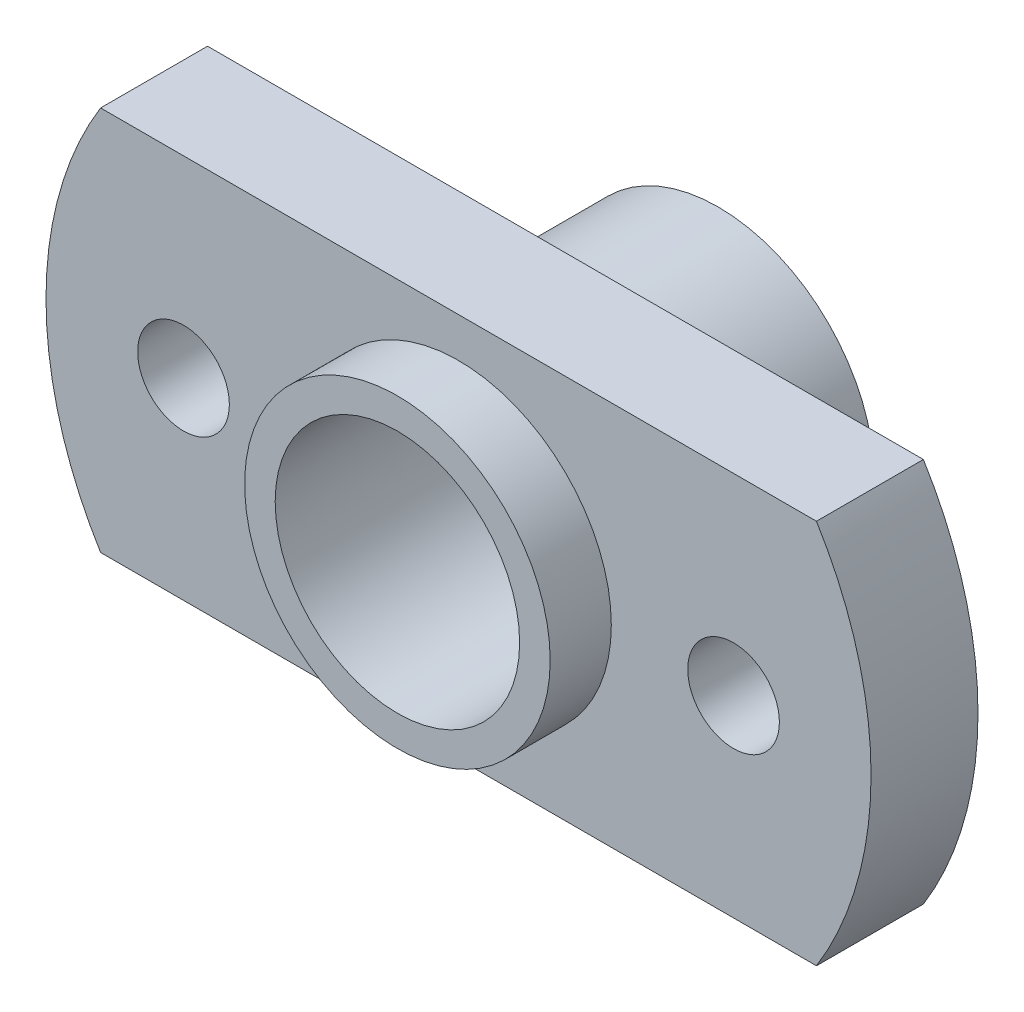
ISO-10303-21;
HEADER;
FILE_DESCRIPTION(('STEP AP214'),'2;1');
FILE_NAME('part.step','',(''),(''),'','','');
FILE_SCHEMA(('AUTOMOTIVE_DESIGN { 1 0 10303 214 1 1 1 1 }'));
ENDSEC;
DATA;
#1=APPLICATION_CONTEXT('core data for automotive mechanical design processes');
#2=APPLICATION_PROTOCOL_DEFINITION('international standard','automotive_design',2000,#1);
#3=PRODUCT_CONTEXT('',#1,'mechanical');
#4=PRODUCT('Part','Part','',(#3));
#5=PRODUCT_RELATED_PRODUCT_CATEGORY('part','',(#4));
#6=PRODUCT_DEFINITION_FORMATION('','',#4);
#7=PRODUCT_DEFINITION_CONTEXT('part definition',#1,'design');
#8=PRODUCT_DEFINITION('design','',#6,#7);
#9=PRODUCT_DEFINITION_SHAPE('','',#8);
#10=(LENGTH_UNIT() NAMED_UNIT(*) SI_UNIT(.MILLI.,.METRE.));
#11=(NAMED_UNIT(*) PLANE_ANGLE_UNIT() SI_UNIT($,.RADIAN.));
#12=(NAMED_UNIT(*) SI_UNIT($,.STERADIAN.) SOLID_ANGLE_UNIT());
#13=UNCERTAINTY_MEASURE_WITH_UNIT(LENGTH_MEASURE(1.E-05),#10,'distance_accuracy_value','');
#14=(GEOMETRIC_REPRESENTATION_CONTEXT(3) GLOBAL_UNCERTAINTY_ASSIGNED_CONTEXT((#13)) GLOBAL_UNIT_ASSIGNED_CONTEXT((#10,
#11,#12)) REPRESENTATION_CONTEXT('',''));
#15=CARTESIAN_POINT('',(0.,0.,0.));
#16=DIRECTION('',(0.,0.,1.));
#17=DIRECTION('',(1.,0.,0.));
#18=AXIS2_PLACEMENT_3D('',#15,#16,#17);
#19=CARTESIAN_POINT('',(-167.599999999995,-80.5000578860021,180.5264319846));
#20=DIRECTION('',(0.,0.,-1.));
#21=DIRECTION('',(-1.,0.,0.));
#22=AXIS2_PLACEMENT_3D('',#19,#20,#21);
#23=CYLINDRICAL_SURFACE('',#22,11.9999999999984);
#24=CARTESIAN_POINT('',(-167.599999999995,-80.5000578860021,177.0264319846));
#25=DIRECTION('',(0.,0.,-1.));
#26=DIRECTION('',(-1.,0.,0.));
#27=AXIS2_PLACEMENT_3D('',#24,#25,#26);
#28=CIRCLE('',#27,11.9999999999984);
#29=CARTESIAN_POINT('',(-177.813226718329,-86.8000578859906,177.0264319846));
#30=VERTEX_POINT('',#29);
#31=CARTESIAN_POINT('',(-177.813226718328,-74.2000578860111,177.0264319846));
#32=VERTEX_POINT('',#31);
#33=EDGE_CURVE('E105',#30,#32,#28,.T.);
#34=ORIENTED_EDGE('',*,*,#33,.F.);
#35=DIRECTION('',(0.,0.,-1.));
#36=VECTOR('',#35,1.);
#37=CARTESIAN_POINT('',(-177.813226718329,-86.8000578859906,180.5264319846));
#38=LINE('',#37,#36);
#39=CARTESIAN_POINT('',(-177.813226718329,-86.8000578859906,180.5264319846));
#40=VERTEX_POINT('',#39);
#41=EDGE_CURVE('E55',#40,#30,#38,.T.);
#42=ORIENTED_EDGE('',*,*,#41,.F.);
#43=CARTESIAN_POINT('',(-167.599999999995,-80.5000578860021,180.5264319846));
#44=DIRECTION('',(0.,0.,-1.));
#45=DIRECTION('',(-1.,0.,0.));
#46=AXIS2_PLACEMENT_3D('',#43,#44,#45);
#47=CIRCLE('',#46,11.9999999999984);
#48=CARTESIAN_POINT('',(-177.813226718328,-74.2000578860111,180.5264319846));
#49=VERTEX_POINT('',#48);
#50=EDGE_CURVE('E98',#40,#49,#47,.T.);
#51=ORIENTED_EDGE('',*,*,#50,.T.);
#52=DIRECTION('',(0.,0.,-1.));
#53=VECTOR('',#52,1.);
#54=CARTESIAN_POINT('',(-177.813226718328,-74.2000578860111,180.5264319846));
#55=LINE('',#54,#53);
#56=EDGE_CURVE('E40',#49,#32,#55,.T.);
#57=ORIENTED_EDGE('',*,*,#56,.T.);
#58=EDGE_LOOP('',(#34,#42,#51,#57));
#59=FACE_BOUND('',#58,.T.);
#60=ADVANCED_FACE('F37',(#59),#23,.T.);
#61=CARTESIAN_POINT('',(-154.386773281659,-86.8000578859906,180.5264319846));
#62=DIRECTION('',(0.,-1.,0.));
#63=DIRECTION('',(0.,0.,-1.));
#64=AXIS2_PLACEMENT_3D('',#61,#62,#63);
#65=PLANE('',#64);
#66=DIRECTION('',(-1.,0.,0.));
#67=VECTOR('',#66,1.);
#68=CARTESIAN_POINT('',(-154.386773281659,-86.8000578859906,177.0264319846));
#69=LINE('',#68,#67);
#70=CARTESIAN_POINT('',(-154.386773281658,-86.8000578859908,177.0264319846));
#71=VERTEX_POINT('',#70);
#72=EDGE_CURVE('E100',#71,#30,#69,.T.);
#73=ORIENTED_EDGE('',*,*,#72,.F.);
#74=DIRECTION('',(0.,0.,-1.));
#75=VECTOR('',#74,1.);
#76=CARTESIAN_POINT('',(-154.386773281658,-86.8000578859908,180.5264319846));
#77=LINE('',#76,#75);
#78=CARTESIAN_POINT('',(-154.386773281658,-86.8000578859908,180.5264319846));
#79=VERTEX_POINT('',#78);
#80=EDGE_CURVE('E72',#79,#71,#77,.T.);
#81=ORIENTED_EDGE('',*,*,#80,.F.);
#82=DIRECTION('',(-1.,0.,0.));
#83=VECTOR('',#82,1.);
#84=CARTESIAN_POINT('',(-154.386773281659,-86.8000578859906,180.5264319846));
#85=LINE('',#84,#83);
#86=EDGE_CURVE('E95',#79,#40,#85,.T.);
#87=ORIENTED_EDGE('',*,*,#86,.T.);
#88=ORIENTED_EDGE('',*,*,#41,.T.);
#89=EDGE_LOOP('',(#73,#81,#87,#88));
#90=FACE_BOUND('',#89,.T.);
#91=ADVANCED_FACE('F164',(#90),#65,.T.);
#92=CARTESIAN_POINT('',(-164.6,-80.50005788601,180.5264319846));
#93=DIRECTION('',(0.,0.,-1.));
#94=DIRECTION('',(-1.,0.,0.));
#95=AXIS2_PLACEMENT_3D('',#92,#93,#94);
#96=CYLINDRICAL_SURFACE('',#95,12.0000000000004);
#97=CARTESIAN_POINT('',(-164.6,-80.50005788601,177.0264319846));
#98=DIRECTION('',(0.,0.,-1.));
#99=DIRECTION('',(-1.,0.,0.));
#100=AXIS2_PLACEMENT_3D('',#97,#98,#99);
#101=CIRCLE('',#100,12.0000000000004);
#102=CARTESIAN_POINT('',(-154.386773281669,-74.2000578860111,177.0264319846));
#103=VERTEX_POINT('',#102);
#104=EDGE_CURVE('E90',#103,#71,#101,.T.);
#105=ORIENTED_EDGE('',*,*,#104,.F.);
#106=DIRECTION('',(0.,0.,-1.));
#107=VECTOR('',#106,1.);
#108=CARTESIAN_POINT('',(-154.386773281669,-74.2000578860111,180.5264319846));
#109=LINE('',#108,#107);
#110=CARTESIAN_POINT('',(-154.386773281669,-74.2000578860111,180.5264319846));
#111=VERTEX_POINT('',#110);
#112=EDGE_CURVE('E85',#111,#103,#109,.T.);
#113=ORIENTED_EDGE('',*,*,#112,.F.);
#114=CARTESIAN_POINT('',(-164.6,-80.50005788601,180.5264319846));
#115=DIRECTION('',(0.,0.,-1.));
#116=DIRECTION('',(-1.,0.,0.));
#117=AXIS2_PLACEMENT_3D('',#114,#115,#116);
#118=CIRCLE('',#117,12.0000000000004);
#119=EDGE_CURVE('E88',#111,#79,#118,.T.);
#120=ORIENTED_EDGE('',*,*,#119,.T.);
#121=ORIENTED_EDGE('',*,*,#80,.T.);
#122=EDGE_LOOP('',(#105,#113,#120,#121));
#123=FACE_BOUND('',#122,.T.);
#124=ADVANCED_FACE('F87',(#123),#96,.T.);
#125=CARTESIAN_POINT('',(-177.813226718328,-74.2000578860111,180.5264319846));
#126=DIRECTION('',(0.,1.,0.));
#127=DIRECTION('',(-1.,0.,0.));
#128=AXIS2_PLACEMENT_3D('',#125,#126,#127);
#129=PLANE('',#128);
#130=DIRECTION('',(1.,0.,0.));
#131=VECTOR('',#130,1.);
#132=CARTESIAN_POINT('',(-177.813226718328,-74.2000578860111,177.0264319846));
#133=LINE('',#132,#131);
#134=EDGE_CURVE('E108',#32,#103,#133,.T.);
#135=ORIENTED_EDGE('',*,*,#134,.F.);
#136=ORIENTED_EDGE('',*,*,#56,.F.);
#137=DIRECTION('',(1.,0.,0.));
#138=VECTOR('',#137,1.);
#139=CARTESIAN_POINT('',(-177.813226718328,-74.2000578860111,180.5264319846));
#140=LINE('',#139,#138);
#141=EDGE_CURVE('E94',#49,#111,#140,.T.);
#142=ORIENTED_EDGE('',*,*,#141,.T.);
#143=ORIENTED_EDGE('',*,*,#112,.T.);
#144=EDGE_LOOP('',(#135,#136,#142,#143));
#145=FACE_BOUND('',#144,.T.);
#146=ADVANCED_FACE('F97',(#145),#129,.T.);
#147=CARTESIAN_POINT('',(-167.599999999995,-80.5000578860021,180.5264319846));
#148=DIRECTION('',(0.,0.,-1.));
#149=DIRECTION('',(-1.,0.,0.));
#150=AXIS2_PLACEMENT_3D('',#147,#148,#149);
#151=PLANE('',#150);
#152=CARTESIAN_POINT('',(-157.1,-80.50005788601,180.5264319846));
#153=DIRECTION('',(0.,0.,1.));
#154=DIRECTION('',(1.,0.,0.));
#155=AXIS2_PLACEMENT_3D('',#152,#153,#154);
#156=CIRCLE('',#155,1.5);
#157=CARTESIAN_POINT('',(-155.6,-80.50005788601,180.5264319846));
#158=VERTEX_POINT('',#157);
#159=EDGE_CURVE('E133',#158,#158,#156,.T.);
#160=ORIENTED_EDGE('',*,*,#159,.F.);
#161=EDGE_LOOP('',(#160));
#162=FACE_BOUND('',#161,.T.);
#163=CARTESIAN_POINT('',(-175.1,-80.50005788601,180.5264319846));
#164=DIRECTION('',(0.,0.,1.));
#165=DIRECTION('',(1.,0.,0.));
#166=AXIS2_PLACEMENT_3D('',#163,#164,#165);
#167=CIRCLE('',#166,1.5);
#168=CARTESIAN_POINT('',(-173.6,-80.50005788601,180.5264319846));
#169=VERTEX_POINT('',#168);
#170=EDGE_CURVE('E127',#169,#169,#167,.T.);
#171=ORIENTED_EDGE('',*,*,#170,.F.);
#172=EDGE_LOOP('',(#171));
#173=FACE_BOUND('',#172,.T.);
#174=CARTESIAN_POINT('',(-166.1,-80.50005788601,180.5264319846));
#175=DIRECTION('',(0.,0.,1.));
#176=DIRECTION('',(1.,0.,0.));
#177=AXIS2_PLACEMENT_3D('',#174,#175,#176);
#178=CIRCLE('',#177,5.);
#179=CARTESIAN_POINT('',(-161.1,-80.50005788601,180.5264319846));
#180=VERTEX_POINT('',#179);
#181=EDGE_CURVE('E46',#180,#180,#178,.T.);
#182=ORIENTED_EDGE('',*,*,#181,.F.);
#183=EDGE_LOOP('',(#182));
#184=FACE_BOUND('',#183,.T.);
#185=ORIENTED_EDGE('',*,*,#50,.F.);
#186=ORIENTED_EDGE('',*,*,#86,.F.);
#187=ORIENTED_EDGE('',*,*,#119,.F.);
#188=ORIENTED_EDGE('',*,*,#141,.F.);
#189=EDGE_LOOP('',(#185,#186,#187,#188));
#190=FACE_BOUND('',#189,.T.);
#191=ADVANCED_FACE('F93',(#162,#173,#184,#190),#151,.F.);
#192=CARTESIAN_POINT('',(-167.599999999995,-80.5000578860021,177.0264319846));
#193=DIRECTION('',(0.,0.,-1.));
#194=DIRECTION('',(-1.,0.,0.));
#195=AXIS2_PLACEMENT_3D('',#192,#193,#194);
#196=PLANE('',#195);
#197=CARTESIAN_POINT('',(-157.1,-80.50005788601,177.0264319846));
#198=DIRECTION('',(0.,0.,-1.));
#199=DIRECTION('',(-1.,0.,0.));
#200=AXIS2_PLACEMENT_3D('',#197,#198,#199);
#201=CIRCLE('',#200,1.5);
#202=CARTESIAN_POINT('',(-158.6,-80.50005788601,177.0264319846));
#203=VERTEX_POINT('',#202);
#204=EDGE_CURVE('E130',#203,#203,#201,.T.);
#205=ORIENTED_EDGE('',*,*,#204,.F.);
#206=EDGE_LOOP('',(#205));
#207=FACE_BOUND('',#206,.T.);
#208=CARTESIAN_POINT('',(-175.1,-80.50005788601,177.0264319846));
#209=DIRECTION('',(0.,0.,-1.));
#210=DIRECTION('',(-1.,0.,0.));
#211=AXIS2_PLACEMENT_3D('',#208,#209,#210);
#212=CIRCLE('',#211,1.5);
#213=CARTESIAN_POINT('',(-176.6,-80.50005788601,177.0264319846));
#214=VERTEX_POINT('',#213);
#215=EDGE_CURVE('E124',#214,#214,#212,.T.);
#216=ORIENTED_EDGE('',*,*,#215,.F.);
#217=EDGE_LOOP('',(#216));
#218=FACE_BOUND('',#217,.T.);
#219=CARTESIAN_POINT('',(-166.1,-80.50005788601,177.0264319846));
#220=DIRECTION('',(0.,0.,-1.));
#221=DIRECTION('',(-1.,0.,0.));
#222=AXIS2_PLACEMENT_3D('',#219,#220,#221);
#223=CIRCLE('',#222,5.09999999999999);
#224=CARTESIAN_POINT('',(-171.2,-80.50005788601,177.0264319846));
#225=VERTEX_POINT('',#224);
#226=EDGE_CURVE('E11',#225,#225,#223,.T.);
#227=ORIENTED_EDGE('',*,*,#226,.F.);
#228=EDGE_LOOP('',(#227));
#229=FACE_BOUND('',#228,.T.);
#230=ORIENTED_EDGE('',*,*,#33,.T.);
#231=ORIENTED_EDGE('',*,*,#134,.T.);
#232=ORIENTED_EDGE('',*,*,#104,.T.);
#233=ORIENTED_EDGE('',*,*,#72,.T.);
#234=EDGE_LOOP('',(#230,#231,#232,#233));
#235=FACE_BOUND('',#234,.T.);
#236=ADVANCED_FACE('F170',(#207,#218,#229,#235),#196,.T.);
#237=CARTESIAN_POINT('',(-166.1,-80.50005788601,180.5264319846));
#238=DIRECTION('',(0.,0.,1.));
#239=DIRECTION('',(1.,0.,0.));
#240=AXIS2_PLACEMENT_3D('',#237,#238,#239);
#241=CYLINDRICAL_SURFACE('',#240,5.00000000000002);
#242=ORIENTED_EDGE('',*,*,#181,.T.);
#243=EDGE_LOOP('',(#242));
#244=FACE_BOUND('',#243,.T.);
#245=CARTESIAN_POINT('',(-166.1,-80.50005788601,182.5264319846));
#246=DIRECTION('',(0.,0.,1.));
#247=DIRECTION('',(1.,0.,0.));
#248=AXIS2_PLACEMENT_3D('',#245,#246,#247);
#249=CIRCLE('',#248,5.00000000000003);
#250=CARTESIAN_POINT('',(-161.1,-80.50005788601,182.5264319846));
#251=VERTEX_POINT('',#250);
#252=EDGE_CURVE('E109',#251,#251,#249,.T.);
#253=ORIENTED_EDGE('',*,*,#252,.F.);
#254=EDGE_LOOP('',(#253));
#255=FACE_BOUND('',#254,.T.);
#256=ADVANCED_FACE('F160',(#244,#255),#241,.T.);
#257=CARTESIAN_POINT('',(-166.1,-80.50005788601,182.5264319846));
#258=DIRECTION('',(0.,0.,1.));
#259=DIRECTION('',(1.,0.,0.));
#260=AXIS2_PLACEMENT_3D('',#257,#258,#259);
#261=PLANE('',#260);
#262=CARTESIAN_POINT('',(-166.1,-80.50005788601,182.5264319846));
#263=DIRECTION('',(0.,0.,-1.));
#264=DIRECTION('',(-1.,0.,0.));
#265=AXIS2_PLACEMENT_3D('',#262,#263,#264);
#266=CIRCLE('',#265,4.);
#267=CARTESIAN_POINT('',(-170.1,-80.50005788601,182.5264319846));
#268=VERTEX_POINT('',#267);
#269=EDGE_CURVE('E136',#268,#268,#266,.T.);
#270=ORIENTED_EDGE('',*,*,#269,.T.);
#271=EDGE_LOOP('',(#270));
#272=FACE_BOUND('',#271,.T.);
#273=ORIENTED_EDGE('',*,*,#252,.T.);
#274=EDGE_LOOP('',(#273));
#275=FACE_BOUND('',#274,.T.);
#276=ADVANCED_FACE('F154',(#272,#275),#261,.T.);
#277=CARTESIAN_POINT('',(-166.1,-80.50005788601,177.0264319846));
#278=DIRECTION('',(0.,0.,-1.));
#279=DIRECTION('',(-1.,0.,0.));
#280=AXIS2_PLACEMENT_3D('',#277,#278,#279);
#281=CYLINDRICAL_SURFACE('',#280,5.09999999999999);
#282=ORIENTED_EDGE('',*,*,#226,.T.);
#283=EDGE_LOOP('',(#282));
#284=FACE_BOUND('',#283,.T.);
#285=CARTESIAN_POINT('',(-166.1,-80.50005788601,172.0264319846));
#286=DIRECTION('',(0.,0.,-1.));
#287=DIRECTION('',(-1.,0.,0.));
#288=AXIS2_PLACEMENT_3D('',#285,#286,#287);
#289=CIRCLE('',#288,5.09999999999999);
#290=CARTESIAN_POINT('',(-171.2,-80.50005788601,172.0264319846));
#291=VERTEX_POINT('',#290);
#292=EDGE_CURVE('E120',#291,#291,#289,.T.);
#293=ORIENTED_EDGE('',*,*,#292,.F.);
#294=EDGE_LOOP('',(#293));
#295=FACE_BOUND('',#294,.T.);
#296=ADVANCED_FACE('F149',(#284,#295),#281,.T.);
#297=CARTESIAN_POINT('',(-166.1,-80.50005788601,172.0264319846));
#298=DIRECTION('',(0.,0.,-1.));
#299=DIRECTION('',(-1.,0.,0.));
#300=AXIS2_PLACEMENT_3D('',#297,#298,#299);
#301=PLANE('',#300);
#302=CARTESIAN_POINT('',(-166.1,-80.50005788601,172.0264319846));
#303=DIRECTION('',(0.,0.,-1.));
#304=DIRECTION('',(-1.,0.,0.));
#305=AXIS2_PLACEMENT_3D('',#302,#303,#304);
#306=CIRCLE('',#305,4.);
#307=CARTESIAN_POINT('',(-170.1,-80.50005788601,172.0264319846));
#308=VERTEX_POINT('',#307);
#309=EDGE_CURVE('E139',#308,#308,#306,.T.);
#310=ORIENTED_EDGE('',*,*,#309,.F.);
#311=EDGE_LOOP('',(#310));
#312=FACE_BOUND('',#311,.T.);
#313=ORIENTED_EDGE('',*,*,#292,.T.);
#314=EDGE_LOOP('',(#313));
#315=FACE_BOUND('',#314,.T.);
#316=ADVANCED_FACE('F145',(#312,#315),#301,.T.);
#317=CARTESIAN_POINT('',(-175.1,-80.50005788601,180.5264319846));
#318=DIRECTION('',(0.,0.,1.));
#319=DIRECTION('',(1.,0.,0.));
#320=AXIS2_PLACEMENT_3D('',#317,#318,#319);
#321=CYLINDRICAL_SURFACE('',#320,1.5);
#322=ORIENTED_EDGE('',*,*,#215,.T.);
#323=EDGE_LOOP('',(#322));
#324=FACE_BOUND('',#323,.T.);
#325=ORIENTED_EDGE('',*,*,#170,.T.);
#326=EDGE_LOOP('',(#325));
#327=FACE_BOUND('',#326,.T.);
#328=ADVANCED_FACE('F148',(#324,#327),#321,.F.);
#329=CARTESIAN_POINT('',(-157.1,-80.50005788601,180.5264319846));
#330=DIRECTION('',(0.,0.,1.));
#331=DIRECTION('',(1.,0.,0.));
#332=AXIS2_PLACEMENT_3D('',#329,#330,#331);
#333=CYLINDRICAL_SURFACE('',#332,1.5);
#334=ORIENTED_EDGE('',*,*,#204,.T.);
#335=EDGE_LOOP('',(#334));
#336=FACE_BOUND('',#335,.T.);
#337=ORIENTED_EDGE('',*,*,#159,.T.);
#338=EDGE_LOOP('',(#337));
#339=FACE_BOUND('',#338,.T.);
#340=ADVANCED_FACE('F213',(#336,#339),#333,.F.);
#341=CARTESIAN_POINT('',(-166.1,-80.50005788601,172.0264319846));
#342=DIRECTION('',(0.,0.,-1.));
#343=DIRECTION('',(-1.,0.,0.));
#344=AXIS2_PLACEMENT_3D('',#341,#342,#343);
#345=CYLINDRICAL_SURFACE('',#344,4.);
#346=ORIENTED_EDGE('',*,*,#269,.F.);
#347=EDGE_LOOP('',(#346));
#348=FACE_BOUND('',#347,.T.);
#349=ORIENTED_EDGE('',*,*,#309,.T.);
#350=EDGE_LOOP('',(#349));
#351=FACE_BOUND('',#350,.T.);
#352=ADVANCED_FACE('F143',(#348,#351),#345,.F.);
#353=CLOSED_SHELL('',(#60,#91,#124,#146,#191,#236,#256,#276,#296,#316,#328,#340,#352));
#354=MANIFOLD_SOLID_BREP('B2',#353);
#355=ADVANCED_BREP_SHAPE_REPRESENTATION('',(#18,#354),#14);
#356=SHAPE_DEFINITION_REPRESENTATION(#9,#355);
ENDSEC;
END-ISO-10303-21;
